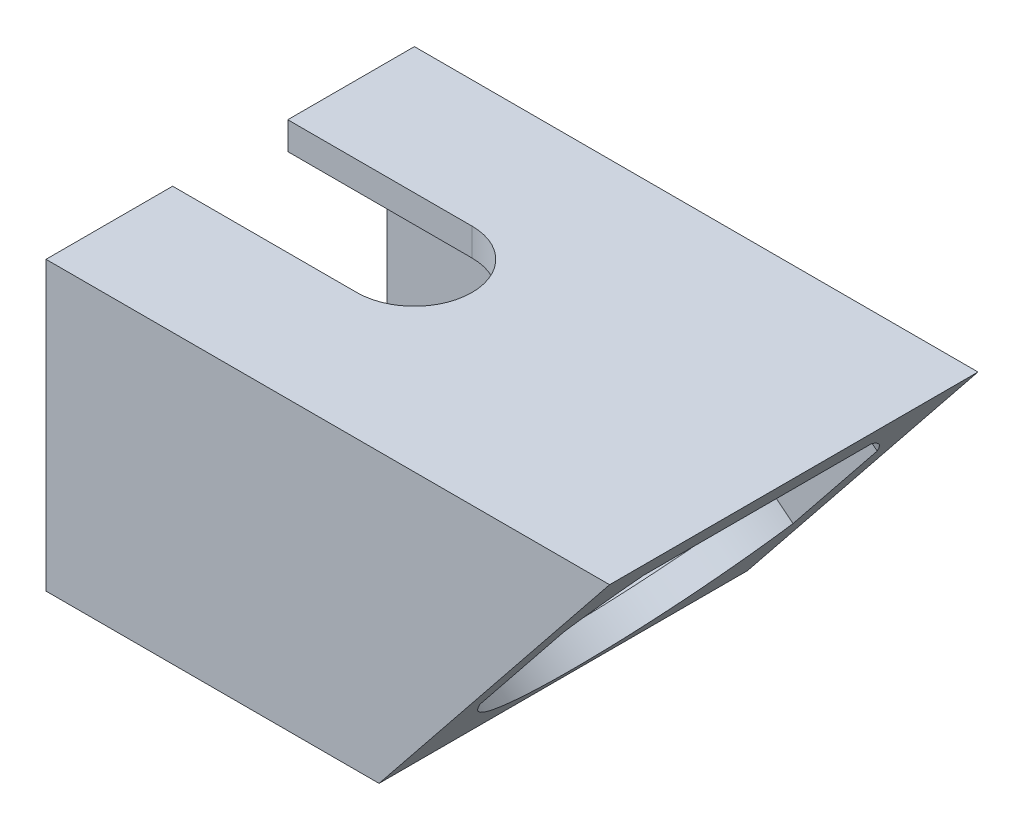
ISO-10303-21;
HEADER;
FILE_DESCRIPTION(('STEP AP214'),'2;1');
FILE_NAME('part.step','',(''),(''),'','','');
FILE_SCHEMA(('AUTOMOTIVE_DESIGN { 1 0 10303 214 1 1 1 1 }'));
ENDSEC;
DATA;
#1=APPLICATION_CONTEXT('core data for automotive mechanical design processes');
#2=APPLICATION_PROTOCOL_DEFINITION('international standard','automotive_design',2000,#1);
#3=PRODUCT_CONTEXT('',#1,'mechanical');
#4=PRODUCT('Part','Part','',(#3));
#5=PRODUCT_RELATED_PRODUCT_CATEGORY('part','',(#4));
#6=PRODUCT_DEFINITION_FORMATION('','',#4);
#7=PRODUCT_DEFINITION_CONTEXT('part definition',#1,'design');
#8=PRODUCT_DEFINITION('design','',#6,#7);
#9=PRODUCT_DEFINITION_SHAPE('','',#8);
#10=(LENGTH_UNIT() NAMED_UNIT(*) SI_UNIT(.MILLI.,.METRE.));
#11=(NAMED_UNIT(*) PLANE_ANGLE_UNIT() SI_UNIT($,.RADIAN.));
#12=(NAMED_UNIT(*) SI_UNIT($,.STERADIAN.) SOLID_ANGLE_UNIT());
#13=UNCERTAINTY_MEASURE_WITH_UNIT(LENGTH_MEASURE(1.E-05),#10,'distance_accuracy_value','');
#14=(GEOMETRIC_REPRESENTATION_CONTEXT(3) GLOBAL_UNCERTAINTY_ASSIGNED_CONTEXT((#13)) GLOBAL_UNIT_ASSIGNED_CONTEXT((#10,
#11,#12)) REPRESENTATION_CONTEXT('',''));
#15=CARTESIAN_POINT('',(0.,0.,0.));
#16=DIRECTION('',(0.,0.,1.));
#17=DIRECTION('',(1.,0.,0.));
#18=AXIS2_PLACEMENT_3D('',#15,#16,#17);
#19=CARTESIAN_POINT('',(38.8511805554592,-2.92266145834056,-20.));
#20=DIRECTION('',(0.78,-0.625779513886481,0.));
#21=DIRECTION('',(0.625779513886481,0.78,0.));
#22=AXIS2_PLACEMENT_3D('',#19,#20,#21);
#23=PLANE('',#22);
#24=DIRECTION('',(0.,0.,-1.));
#25=VECTOR('',#24,1.);
#26=CARTESIAN_POINT('',(34.9381824251266,-7.79999999999999,17.));
#27=LINE('',#26,#25);
#28=CARTESIAN_POINT('',(34.9381824251266,-7.79999999999998,17.));
#29=VERTEX_POINT('',#28);
#30=CARTESIAN_POINT('',(34.9381824251266,-7.79999999999999,12.3802237296166));
#31=VERTEX_POINT('',#30);
#32=EDGE_CURVE('E255',#29,#31,#27,.T.);
#33=ORIENTED_EDGE('',*,*,#32,.T.);
#34=CARTESIAN_POINT('',(26.3355902777296,-18.5226614583406,0.));
#35=DIRECTION('',(-0.78,0.625779513886481,0.));
#36=DIRECTION('',(-0.625779513886481,-0.78,0.));
#37=AXIS2_PLACEMENT_3D('',#34,#35,#36);
#38=CIRCLE('',#37,18.5);
#39=CARTESIAN_POINT('',(30.902065942835,-12.8307988458033,17.));
#40=VERTEX_POINT('',#39);
#41=EDGE_CURVE('E202',#40,#31,#38,.T.);
#42=ORIENTED_EDGE('',*,*,#41,.F.);
#43=DIRECTION('',(0.625779513886481,0.78,0.));
#44=VECTOR('',#43,1.);
#45=CARTESIAN_POINT('',(38.7640405728007,-3.03127668936898,17.));
#46=LINE('',#45,#44);
#47=EDGE_CURVE('E264',#40,#29,#46,.T.);
#48=ORIENTED_EDGE('',*,*,#47,.T.);
#49=EDGE_LOOP('',(#33,#42,#48));
#50=FACE_BOUND('',#49,.T.);
#51=ADVANCED_FACE('F35',(#50),#23,.F.);
#52=DIRECTION('',(-0.625779513886481,-0.78,0.));
#53=VECTOR('',#52,1.);
#54=CARTESIAN_POINT('',(51.0643626977534,12.300403310631,-17.));
#55=LINE('',#54,#53);
#56=CARTESIAN_POINT('',(34.9381824251266,-7.79999999999999,-17.));
#57=VERTEX_POINT('',#56);
#58=CARTESIAN_POINT('',(30.902065942835,-12.8307988458032,-17.));
#59=VERTEX_POINT('',#58);
#60=EDGE_CURVE('E250',#57,#59,#55,.T.);
#61=ORIENTED_EDGE('',*,*,#60,.T.);
#62=CARTESIAN_POINT('',(26.3355902777296,-18.5226614583406,0.));
#63=DIRECTION('',(-0.78,0.625779513886481,0.));
#64=DIRECTION('',(-0.625779513886481,-0.78,0.));
#65=AXIS2_PLACEMENT_3D('',#62,#63,#64);
#66=CIRCLE('',#65,18.5);
#67=CARTESIAN_POINT('',(34.9381824251266,-7.79999999999999,-12.3802237296166));
#68=VERTEX_POINT('',#67);
#69=EDGE_CURVE('E196',#68,#59,#66,.T.);
#70=ORIENTED_EDGE('',*,*,#69,.F.);
#71=EDGE_CURVE('E259',#68,#57,#27,.T.);
#72=ORIENTED_EDGE('',*,*,#71,.T.);
#73=EDGE_LOOP('',(#61,#70,#72));
#74=FACE_BOUND('',#73,.T.);
#75=ADVANCED_FACE('F334',(#74),#23,.F.);
#76=CARTESIAN_POINT('',(-20.,-4.8,-20.));
#77=DIRECTION('',(-1.,0.,0.));
#78=DIRECTION('',(0.,-1.,0.));
#79=AXIS2_PLACEMENT_3D('',#76,#77,#78);
#80=PLANE('',#79);
#81=DIRECTION('',(0.,1.,0.));
#82=VECTOR('',#81,1.);
#83=CARTESIAN_POINT('',(-20.,-36.001,-6.25));
#84=LINE('',#83,#82);
#85=CARTESIAN_POINT('',(-20.,-7.8,-6.25));
#86=VERTEX_POINT('',#85);
#87=CARTESIAN_POINT('',(-20.,-4.8,-6.25));
#88=VERTEX_POINT('',#87);
#89=EDGE_CURVE('E191',#86,#88,#84,.T.);
#90=ORIENTED_EDGE('',*,*,#89,.T.);
#91=DIRECTION('',(0.,0.,1.));
#92=VECTOR('',#91,1.);
#93=CARTESIAN_POINT('',(-20.,-4.8,-20.));
#94=LINE('',#93,#92);
#95=CARTESIAN_POINT('',(-20.,-4.8,-20.));
#96=VERTEX_POINT('',#95);
#97=EDGE_CURVE('E12',#96,#88,#94,.T.);
#98=ORIENTED_EDGE('',*,*,#97,.F.);
#99=DIRECTION('',(0.,-1.,0.));
#100=VECTOR('',#99,1.);
#101=CARTESIAN_POINT('',(-20.,-4.8,-20.));
#102=LINE('',#101,#100);
#103=CARTESIAN_POINT('',(-20.,-36.,-20.));
#104=VERTEX_POINT('',#103);
#105=EDGE_CURVE('E282',#96,#104,#102,.T.);
#106=ORIENTED_EDGE('',*,*,#105,.T.);
#107=DIRECTION('',(0.,0.,1.));
#108=VECTOR('',#107,1.);
#109=CARTESIAN_POINT('',(-20.,-36.,-20.));
#110=LINE('',#109,#108);
#111=CARTESIAN_POINT('',(-20.,-36.,20.));
#112=VERTEX_POINT('',#111);
#113=EDGE_CURVE('E39',#104,#112,#110,.T.);
#114=ORIENTED_EDGE('',*,*,#113,.T.);
#115=DIRECTION('',(0.,-1.,0.));
#116=VECTOR('',#115,1.);
#117=CARTESIAN_POINT('',(-20.,-4.8,20.));
#118=LINE('',#117,#116);
#119=CARTESIAN_POINT('',(-20.,-4.8,20.));
#120=VERTEX_POINT('',#119);
#121=EDGE_CURVE('E270',#120,#112,#118,.T.);
#122=ORIENTED_EDGE('',*,*,#121,.F.);
#123=CARTESIAN_POINT('',(-20.,-4.8,6.25));
#124=VERTEX_POINT('',#123);
#125=EDGE_CURVE('E44',#124,#120,#94,.T.);
#126=ORIENTED_EDGE('',*,*,#125,.F.);
#127=DIRECTION('',(0.,1.,0.));
#128=VECTOR('',#127,1.);
#129=CARTESIAN_POINT('',(-20.,-36.001,6.25));
#130=LINE('',#129,#128);
#131=CARTESIAN_POINT('',(-20.,-7.8,6.25));
#132=VERTEX_POINT('',#131);
#133=EDGE_CURVE('E173',#132,#124,#130,.T.);
#134=ORIENTED_EDGE('',*,*,#133,.F.);
#135=DIRECTION('',(0.,0.,-1.));
#136=VECTOR('',#135,1.);
#137=CARTESIAN_POINT('',(-20.,-7.8,17.));
#138=LINE('',#137,#136);
#139=CARTESIAN_POINT('',(-20.,-7.8,17.));
#140=VERTEX_POINT('',#139);
#141=EDGE_CURVE('E183',#140,#132,#138,.T.);
#142=ORIENTED_EDGE('',*,*,#141,.F.);
#143=DIRECTION('',(0.,1.,0.));
#144=VECTOR('',#143,1.);
#145=CARTESIAN_POINT('',(-20.,-33.,17.));
#146=LINE('',#145,#144);
#147=CARTESIAN_POINT('',(-20.,-33.,17.));
#148=VERTEX_POINT('',#147);
#149=EDGE_CURVE('E239',#148,#140,#146,.T.);
#150=ORIENTED_EDGE('',*,*,#149,.F.);
#151=DIRECTION('',(0.,0.,1.));
#152=VECTOR('',#151,1.);
#153=CARTESIAN_POINT('',(-20.,-33.,-17.));
#154=LINE('',#153,#152);
#155=CARTESIAN_POINT('',(-20.,-33.,-17.));
#156=VERTEX_POINT('',#155);
#157=EDGE_CURVE('E242',#156,#148,#154,.T.);
#158=ORIENTED_EDGE('',*,*,#157,.F.);
#159=DIRECTION('',(0.,-1.,0.));
#160=VECTOR('',#159,1.);
#161=CARTESIAN_POINT('',(-20.,-7.8,-17.));
#162=LINE('',#161,#160);
#163=CARTESIAN_POINT('',(-20.,-7.79999999999999,-17.));
#164=VERTEX_POINT('',#163);
#165=EDGE_CURVE('E235',#164,#156,#162,.T.);
#166=ORIENTED_EDGE('',*,*,#165,.F.);
#167=EDGE_CURVE('E238',#86,#164,#138,.T.);
#168=ORIENTED_EDGE('',*,*,#167,.F.);
#169=EDGE_LOOP('',(#90,#98,#106,#114,#122,#126,#134,#142,#150,#158,#166,#168));
#170=FACE_BOUND('',#169,.T.);
#171=ADVANCED_FACE('F37',(#170),#80,.T.);
#172=CARTESIAN_POINT('',(-20.,-4.8,-20.));
#173=DIRECTION('',(0.,1.,0.));
#174=DIRECTION('',(-1.,0.,0.));
#175=AXIS2_PLACEMENT_3D('',#172,#173,#174);
#176=PLANE('',#175);
#177=DIRECTION('',(-1.,0.,0.));
#178=VECTOR('',#177,1.);
#179=CARTESIAN_POINT('',(0.,-4.8,-6.25));
#180=LINE('',#179,#178);
#181=CARTESIAN_POINT('',(0.,-4.8,-6.25));
#182=VERTEX_POINT('',#181);
#183=EDGE_CURVE('E387',#182,#88,#180,.T.);
#184=ORIENTED_EDGE('',*,*,#183,.F.);
#185=CARTESIAN_POINT('',(0.,-4.8,0.));
#186=DIRECTION('',(0.,1.,0.));
#187=DIRECTION('',(-1.,0.,0.));
#188=AXIS2_PLACEMENT_3D('',#185,#186,#187);
#189=CIRCLE('',#188,6.25);
#190=CARTESIAN_POINT('',(0.,-4.8,6.25));
#191=VERTEX_POINT('',#190);
#192=EDGE_CURVE('E185',#191,#182,#189,.T.);
#193=ORIENTED_EDGE('',*,*,#192,.F.);
#194=DIRECTION('',(1.,0.,0.));
#195=VECTOR('',#194,1.);
#196=CARTESIAN_POINT('',(0.,-4.8,6.25));
#197=LINE('',#196,#195);
#198=EDGE_CURVE('E168',#124,#191,#197,.T.);
#199=ORIENTED_EDGE('',*,*,#198,.F.);
#200=ORIENTED_EDGE('',*,*,#125,.T.);
#201=DIRECTION('',(-1.,0.,0.));
#202=VECTOR('',#201,1.);
#203=CARTESIAN_POINT('',(-20.,-4.8,20.));
#204=LINE('',#203,#202);
#205=CARTESIAN_POINT('',(41.1911805554592,-4.8,20.));
#206=VERTEX_POINT('',#205);
#207=EDGE_CURVE('E279',#206,#120,#204,.T.);
#208=ORIENTED_EDGE('',*,*,#207,.F.);
#209=DIRECTION('',(0.,0.,1.));
#210=VECTOR('',#209,1.);
#211=CARTESIAN_POINT('',(41.1911805554592,-4.8,-20.));
#212=LINE('',#211,#210);
#213=CARTESIAN_POINT('',(41.1911805554592,-4.8,-20.));
#214=VERTEX_POINT('',#213);
#215=EDGE_CURVE('E294',#214,#206,#212,.T.);
#216=ORIENTED_EDGE('',*,*,#215,.F.);
#217=DIRECTION('',(-1.,0.,0.));
#218=VECTOR('',#217,1.);
#219=CARTESIAN_POINT('',(-20.,-4.8,-20.));
#220=LINE('',#219,#218);
#221=EDGE_CURVE('E291',#214,#96,#220,.T.);
#222=ORIENTED_EDGE('',*,*,#221,.T.);
#223=ORIENTED_EDGE('',*,*,#97,.T.);
#224=EDGE_LOOP('',(#184,#193,#199,#200,#208,#216,#222,#223));
#225=FACE_BOUND('',#224,.T.);
#226=ADVANCED_FACE('F310',(#225),#176,.T.);
#227=CARTESIAN_POINT('',(41.1911805554592,-4.8,-20.));
#228=DIRECTION('',(0.78,-0.625779513886481,0.));
#229=DIRECTION('',(0.625779513886481,0.78,0.));
#230=AXIS2_PLACEMENT_3D('',#227,#228,#229);
#231=PLANE('',#230);
#232=DIRECTION('',(0.625779513886481,0.78,0.));
#233=VECTOR('',#232,1.);
#234=CARTESIAN_POINT('',(24.1091146126242,-26.0918626125373,17.));
#235=LINE('',#234,#233);
#236=CARTESIAN_POINT('',(24.1091146126242,-26.0918626125373,17.));
#237=VERTEX_POINT('',#236);
#238=CARTESIAN_POINT('',(33.242065942835,-14.7081373874627,17.));
#239=VERTEX_POINT('',#238);
#240=EDGE_CURVE('E198',#237,#239,#235,.T.);
#241=ORIENTED_EDGE('',*,*,#240,.T.);
#242=CARTESIAN_POINT('',(28.6755902777296,-20.4,0.));
#243=DIRECTION('',(0.78,-0.625779513886481,0.));
#244=DIRECTION('',(0.625779513886481,0.78,0.));
#245=AXIS2_PLACEMENT_3D('',#242,#243,#244);
#246=CIRCLE('',#245,18.5);
#247=CARTESIAN_POINT('',(37.2781824251266,-9.67733854165942,12.3802237296166));
#248=VERTEX_POINT('',#247);
#249=EDGE_CURVE('E225',#239,#248,#246,.F.);
#250=ORIENTED_EDGE('',*,*,#249,.T.);
#251=DIRECTION('',(0.,0.,-1.));
#252=VECTOR('',#251,1.);
#253=CARTESIAN_POINT('',(37.2781824251266,-9.67733854165943,12.3802237296166));
#254=LINE('',#253,#252);
#255=CARTESIAN_POINT('',(37.2781824251266,-9.67733854165943,-12.3802237296166));
#256=VERTEX_POINT('',#255);
#257=EDGE_CURVE('E221',#248,#256,#254,.T.);
#258=ORIENTED_EDGE('',*,*,#257,.T.);
#259=CARTESIAN_POINT('',(28.6755902777296,-20.4,0.));
#260=DIRECTION('',(0.78,-0.625779513886481,0.));
#261=DIRECTION('',(0.625779513886481,0.78,0.));
#262=AXIS2_PLACEMENT_3D('',#259,#260,#261);
#263=CIRCLE('',#262,18.5);
#264=CARTESIAN_POINT('',(33.242065942835,-14.7081373874627,-17.));
#265=VERTEX_POINT('',#264);
#266=EDGE_CURVE('E217',#256,#265,#263,.F.);
#267=ORIENTED_EDGE('',*,*,#266,.T.);
#268=DIRECTION('',(-0.625779513886481,-0.78,0.));
#269=VECTOR('',#268,1.);
#270=CARTESIAN_POINT('',(33.242065942835,-14.7081373874627,-17.));
#271=LINE('',#270,#269);
#272=CARTESIAN_POINT('',(24.1091146126242,-26.0918626125373,-17.));
#273=VERTEX_POINT('',#272);
#274=EDGE_CURVE('E213',#265,#273,#271,.T.);
#275=ORIENTED_EDGE('',*,*,#274,.T.);
#276=CARTESIAN_POINT('',(28.6755902777296,-20.4,0.));
#277=DIRECTION('',(0.78,-0.625779513886481,0.));
#278=DIRECTION('',(0.625779513886481,0.78,0.));
#279=AXIS2_PLACEMENT_3D('',#276,#277,#278);
#280=CIRCLE('',#279,18.5);
#281=EDGE_CURVE('E209',#273,#237,#280,.F.);
#282=ORIENTED_EDGE('',*,*,#281,.T.);
#283=EDGE_LOOP('',(#241,#250,#258,#267,#275,#282));
#284=FACE_BOUND('',#283,.T.);
#285=ORIENTED_EDGE('',*,*,#215,.T.);
#286=DIRECTION('',(0.625779513886481,0.78,0.));
#287=VECTOR('',#286,1.);
#288=CARTESIAN_POINT('',(41.1911805554592,-4.8,20.));
#289=LINE('',#288,#287);
#290=CARTESIAN_POINT('',(16.16,-36.,20.));
#291=VERTEX_POINT('',#290);
#292=EDGE_CURVE('E276',#291,#206,#289,.T.);
#293=ORIENTED_EDGE('',*,*,#292,.F.);
#294=DIRECTION('',(0.,0.,1.));
#295=VECTOR('',#294,1.);
#296=CARTESIAN_POINT('',(16.16,-36.,-20.));
#297=LINE('',#296,#295);
#298=CARTESIAN_POINT('',(16.16,-36.,-20.));
#299=VERTEX_POINT('',#298);
#300=EDGE_CURVE('E295',#299,#291,#297,.T.);
#301=ORIENTED_EDGE('',*,*,#300,.F.);
#302=DIRECTION('',(0.625779513886481,0.78,0.));
#303=VECTOR('',#302,1.);
#304=CARTESIAN_POINT('',(41.1911805554592,-4.8,-20.));
#305=LINE('',#304,#303);
#306=EDGE_CURVE('E288',#299,#214,#305,.T.);
#307=ORIENTED_EDGE('',*,*,#306,.T.);
#308=EDGE_LOOP('',(#285,#293,#301,#307));
#309=FACE_BOUND('',#308,.T.);
#310=ADVANCED_FACE('F341',(#284,#309),#231,.T.);
#311=CARTESIAN_POINT('',(16.16,-36.,-20.));
#312=DIRECTION('',(0.,-1.,0.));
#313=DIRECTION('',(1.,0.,0.));
#314=AXIS2_PLACEMENT_3D('',#311,#312,#313);
#315=PLANE('',#314);
#316=ORIENTED_EDGE('',*,*,#300,.T.);
#317=DIRECTION('',(1.,0.,0.));
#318=VECTOR('',#317,1.);
#319=CARTESIAN_POINT('',(16.16,-36.,20.));
#320=LINE('',#319,#318);
#321=EDGE_CURVE('E273',#112,#291,#320,.T.);
#322=ORIENTED_EDGE('',*,*,#321,.F.);
#323=ORIENTED_EDGE('',*,*,#113,.F.);
#324=DIRECTION('',(1.,0.,0.));
#325=VECTOR('',#324,1.);
#326=CARTESIAN_POINT('',(16.16,-36.,-20.));
#327=LINE('',#326,#325);
#328=EDGE_CURVE('E285',#104,#299,#327,.T.);
#329=ORIENTED_EDGE('',*,*,#328,.T.);
#330=EDGE_LOOP('',(#316,#322,#323,#329));
#331=FACE_BOUND('',#330,.T.);
#332=ADVANCED_FACE('F303',(#331),#315,.T.);
#333=CARTESIAN_POINT('',(0.,0.,-20.));
#334=DIRECTION('',(0.,0.,-1.));
#335=DIRECTION('',(-1.,0.,0.));
#336=AXIS2_PLACEMENT_3D('',#333,#334,#335);
#337=PLANE('',#336);
#338=ORIENTED_EDGE('',*,*,#105,.F.);
#339=ORIENTED_EDGE('',*,*,#221,.F.);
#340=ORIENTED_EDGE('',*,*,#306,.F.);
#341=ORIENTED_EDGE('',*,*,#328,.F.);
#342=EDGE_LOOP('',(#338,#339,#340,#341));
#343=FACE_BOUND('',#342,.T.);
#344=ADVANCED_FACE('F362',(#343),#337,.T.);
#345=CARTESIAN_POINT('',(0.,0.,20.));
#346=DIRECTION('',(0.,0.,-1.));
#347=DIRECTION('',(-1.,0.,0.));
#348=AXIS2_PLACEMENT_3D('',#345,#346,#347);
#349=PLANE('',#348);
#350=ORIENTED_EDGE('',*,*,#121,.T.);
#351=ORIENTED_EDGE('',*,*,#321,.T.);
#352=ORIENTED_EDGE('',*,*,#292,.T.);
#353=ORIENTED_EDGE('',*,*,#207,.T.);
#354=EDGE_LOOP('',(#350,#351,#352,#353));
#355=FACE_BOUND('',#354,.T.);
#356=ADVANCED_FACE('F306',(#355),#349,.F.);
#357=CARTESIAN_POINT('',(14.7206904380249,-33.,17.));
#358=VERTEX_POINT('',#357);
#359=CARTESIAN_POINT('',(21.7691146126242,-24.2145240708779,17.));
#360=VERTEX_POINT('',#359);
#361=EDGE_CURVE('E260',#358,#360,#46,.T.);
#362=ORIENTED_EDGE('',*,*,#361,.T.);
#363=CARTESIAN_POINT('',(26.3355902777296,-18.5226614583406,0.));
#364=DIRECTION('',(-0.78,0.625779513886481,0.));
#365=DIRECTION('',(-0.625779513886481,-0.78,0.));
#366=AXIS2_PLACEMENT_3D('',#363,#364,#365);
#367=CIRCLE('',#366,18.5);
#368=CARTESIAN_POINT('',(21.7691146126242,-24.2145240708779,-17.));
#369=VERTEX_POINT('',#368);
#370=EDGE_CURVE('E195',#369,#360,#367,.T.);
#371=ORIENTED_EDGE('',*,*,#370,.F.);
#372=CARTESIAN_POINT('',(14.7206904380249,-33.,-17.));
#373=VERTEX_POINT('',#372);
#374=EDGE_CURVE('E254',#369,#373,#55,.T.);
#375=ORIENTED_EDGE('',*,*,#374,.T.);
#376=DIRECTION('',(0.,0.,1.));
#377=VECTOR('',#376,1.);
#378=CARTESIAN_POINT('',(14.7206904380249,-33.,-17.));
#379=LINE('',#378,#377);
#380=EDGE_CURVE('E237',#373,#358,#379,.T.);
#381=ORIENTED_EDGE('',*,*,#380,.T.);
#382=EDGE_LOOP('',(#362,#371,#375,#381));
#383=FACE_BOUND('',#382,.T.);
#384=ADVANCED_FACE('F354',(#383),#23,.F.);
#385=CARTESIAN_POINT('',(76.1184180549191,-33.,-17.));
#386=DIRECTION('',(0.,-1.,0.));
#387=DIRECTION('',(1.,0.,0.));
#388=AXIS2_PLACEMENT_3D('',#385,#386,#387);
#389=PLANE('',#388);
#390=DIRECTION('',(-1.,0.,0.));
#391=VECTOR('',#390,1.);
#392=CARTESIAN_POINT('',(76.1184180549191,-33.,-17.));
#393=LINE('',#392,#391);
#394=EDGE_CURVE('E253',#373,#156,#393,.T.);
#395=ORIENTED_EDGE('',*,*,#394,.T.);
#396=ORIENTED_EDGE('',*,*,#157,.T.);
#397=DIRECTION('',(-1.,0.,0.));
#398=VECTOR('',#397,1.);
#399=CARTESIAN_POINT('',(76.1184180549191,-33.,17.));
#400=LINE('',#399,#398);
#401=EDGE_CURVE('E249',#358,#148,#400,.T.);
#402=ORIENTED_EDGE('',*,*,#401,.F.);
#403=ORIENTED_EDGE('',*,*,#380,.F.);
#404=EDGE_LOOP('',(#395,#396,#402,#403));
#405=FACE_BOUND('',#404,.T.);
#406=ADVANCED_FACE('F321',(#405),#389,.F.);
#407=CARTESIAN_POINT('',(76.1184180549191,-33.,17.));
#408=DIRECTION('',(0.,0.,1.));
#409=DIRECTION('',(1.,0.,0.));
#410=AXIS2_PLACEMENT_3D('',#407,#408,#409);
#411=PLANE('',#410);
#412=ORIENTED_EDGE('',*,*,#401,.T.);
#413=ORIENTED_EDGE('',*,*,#149,.T.);
#414=DIRECTION('',(-1.,0.,0.));
#415=VECTOR('',#414,1.);
#416=CARTESIAN_POINT('',(76.1184180549191,-7.79999999999998,17.));
#417=LINE('',#416,#415);
#418=EDGE_CURVE('E263',#29,#140,#417,.T.);
#419=ORIENTED_EDGE('',*,*,#418,.F.);
#420=ORIENTED_EDGE('',*,*,#47,.F.);
#421=DIRECTION('',(-0.78,0.625779513886481,0.));
#422=VECTOR('',#421,1.);
#423=CARTESIAN_POINT('',(69.7929452542537,-44.0322290382614,17.));
#424=LINE('',#423,#422);
#425=EDGE_CURVE('E208',#239,#40,#424,.T.);
#426=ORIENTED_EDGE('',*,*,#425,.F.);
#427=ORIENTED_EDGE('',*,*,#240,.F.);
#428=DIRECTION('',(-0.78,0.625779513886481,0.));
#429=VECTOR('',#428,1.);
#430=CARTESIAN_POINT('',(60.6599939240428,-55.415954263336,17.));
#431=LINE('',#430,#429);
#432=EDGE_CURVE('E60',#237,#360,#431,.T.);
#433=ORIENTED_EDGE('',*,*,#432,.T.);
#434=ORIENTED_EDGE('',*,*,#361,.F.);
#435=EDGE_LOOP('',(#412,#413,#419,#420,#426,#427,#433,#434));
#436=FACE_BOUND('',#435,.T.);
#437=ADVANCED_FACE('F316',(#436),#411,.F.);
#438=CARTESIAN_POINT('',(76.1184180549191,-7.79999999999998,17.));
#439=DIRECTION('',(0.,1.,0.));
#440=DIRECTION('',(-1.,0.,0.));
#441=AXIS2_PLACEMENT_3D('',#438,#439,#440);
#442=PLANE('',#441);
#443=CARTESIAN_POINT('',(0.,-7.8,0.));
#444=DIRECTION('',(0.,1.,0.));
#445=DIRECTION('',(-1.,0.,0.));
#446=AXIS2_PLACEMENT_3D('',#443,#444,#445);
#447=CIRCLE('',#446,6.25);
#448=CARTESIAN_POINT('',(0.,-7.8,-6.25));
#449=VERTEX_POINT('',#448);
#450=CARTESIAN_POINT('',(0.,-7.8,6.25));
#451=VERTEX_POINT('',#450);
#452=EDGE_CURVE('E176',#449,#451,#447,.F.);
#453=ORIENTED_EDGE('',*,*,#452,.F.);
#454=DIRECTION('',(1.,0.,0.));
#455=VECTOR('',#454,1.);
#456=CARTESIAN_POINT('',(0.,-7.8,-6.25));
#457=LINE('',#456,#455);
#458=EDGE_CURVE('E52',#86,#449,#457,.T.);
#459=ORIENTED_EDGE('',*,*,#458,.F.);
#460=ORIENTED_EDGE('',*,*,#167,.T.);
#461=DIRECTION('',(-1.,0.,0.));
#462=VECTOR('',#461,1.);
#463=CARTESIAN_POINT('',(76.1184180549191,-7.79999999999998,-17.));
#464=LINE('',#463,#462);
#465=EDGE_CURVE('E258',#57,#164,#464,.T.);
#466=ORIENTED_EDGE('',*,*,#465,.F.);
#467=ORIENTED_EDGE('',*,*,#71,.F.);
#468=DIRECTION('',(0.,0.,-1.));
#469=VECTOR('',#468,1.);
#470=CARTESIAN_POINT('',(34.9381824251266,-7.79999999999999,12.3802237296166));
#471=LINE('',#470,#469);
#472=EDGE_CURVE('E199',#31,#68,#471,.T.);
#473=ORIENTED_EDGE('',*,*,#472,.F.);
#474=ORIENTED_EDGE('',*,*,#32,.F.);
#475=ORIENTED_EDGE('',*,*,#418,.T.);
#476=ORIENTED_EDGE('',*,*,#141,.T.);
#477=DIRECTION('',(-1.,0.,0.));
#478=VECTOR('',#477,1.);
#479=CARTESIAN_POINT('',(0.,-7.8,6.25));
#480=LINE('',#479,#478);
#481=EDGE_CURVE('E165',#451,#132,#480,.T.);
#482=ORIENTED_EDGE('',*,*,#481,.F.);
#483=EDGE_LOOP('',(#453,#459,#460,#466,#467,#473,#474,#475,#476,#482));
#484=FACE_BOUND('',#483,.T.);
#485=ADVANCED_FACE('F181',(#484),#442,.F.);
#486=CARTESIAN_POINT('',(76.1184180549191,-7.79999999999998,-17.));
#487=DIRECTION('',(0.,0.,-1.));
#488=DIRECTION('',(-1.,0.,0.));
#489=AXIS2_PLACEMENT_3D('',#486,#487,#488);
#490=PLANE('',#489);
#491=ORIENTED_EDGE('',*,*,#465,.T.);
#492=ORIENTED_EDGE('',*,*,#165,.T.);
#493=ORIENTED_EDGE('',*,*,#394,.F.);
#494=ORIENTED_EDGE('',*,*,#374,.F.);
#495=DIRECTION('',(-0.78,0.625779513886481,0.));
#496=VECTOR('',#495,1.);
#497=CARTESIAN_POINT('',(60.6599939240428,-55.415954263336,-17.));
#498=LINE('',#497,#496);
#499=EDGE_CURVE('E212',#273,#369,#498,.T.);
#500=ORIENTED_EDGE('',*,*,#499,.F.);
#501=ORIENTED_EDGE('',*,*,#274,.F.);
#502=DIRECTION('',(-0.78,0.625779513886481,0.));
#503=VECTOR('',#502,1.);
#504=CARTESIAN_POINT('',(69.7929452542537,-44.0322290382614,-17.));
#505=LINE('',#504,#503);
#506=EDGE_CURVE('E216',#265,#59,#505,.T.);
#507=ORIENTED_EDGE('',*,*,#506,.T.);
#508=ORIENTED_EDGE('',*,*,#60,.F.);
#509=EDGE_LOOP('',(#491,#492,#493,#494,#500,#501,#507,#508));
#510=FACE_BOUND('',#509,.T.);
#511=ADVANCED_FACE('F325',(#510),#490,.F.);
#512=CARTESIAN_POINT('',(65.2264695891483,-49.7240916507987,0.));
#513=DIRECTION('',(-0.78,0.625779513886481,0.));
#514=DIRECTION('',(-0.625779513886481,-0.78,0.));
#515=AXIS2_PLACEMENT_3D('',#512,#513,#514);
#516=CYLINDRICAL_SURFACE('',#515,18.5);
#517=ORIENTED_EDGE('',*,*,#425,.T.);
#518=ORIENTED_EDGE('',*,*,#41,.T.);
#519=DIRECTION('',(-0.78,0.625779513886481,0.));
#520=VECTOR('',#519,1.);
#521=CARTESIAN_POINT('',(73.8290617365453,-39.0014301924581,12.3802237296166));
#522=LINE('',#521,#520);
#523=EDGE_CURVE('E224',#248,#31,#522,.T.);
#524=ORIENTED_EDGE('',*,*,#523,.F.);
#525=ORIENTED_EDGE('',*,*,#249,.F.);
#526=EDGE_LOOP('',(#517,#518,#524,#525));
#527=FACE_BOUND('',#526,.T.);
#528=ADVANCED_FACE('F347',(#527),#516,.F.);
#529=CARTESIAN_POINT('',(73.8290617365453,-39.0014301924581,12.3802237296166));
#530=DIRECTION('',(0.625779513886481,0.78,0.));
#531=DIRECTION('',(-0.78,0.625779513886481,0.));
#532=AXIS2_PLACEMENT_3D('',#529,#530,#531);
#533=PLANE('',#532);
#534=ORIENTED_EDGE('',*,*,#523,.T.);
#535=ORIENTED_EDGE('',*,*,#472,.T.);
#536=DIRECTION('',(-0.78,0.625779513886481,0.));
#537=VECTOR('',#536,1.);
#538=CARTESIAN_POINT('',(73.8290617365453,-39.0014301924581,-12.3802237296166));
#539=LINE('',#538,#537);
#540=EDGE_CURVE('E220',#256,#68,#539,.T.);
#541=ORIENTED_EDGE('',*,*,#540,.F.);
#542=ORIENTED_EDGE('',*,*,#257,.F.);
#543=EDGE_LOOP('',(#534,#535,#541,#542));
#544=FACE_BOUND('',#543,.T.);
#545=ADVANCED_FACE('F345',(#544),#533,.F.);
#546=CARTESIAN_POINT('',(65.2264695891483,-49.7240916507987,0.));
#547=DIRECTION('',(-0.78,0.625779513886481,0.));
#548=DIRECTION('',(-0.625779513886481,-0.78,0.));
#549=AXIS2_PLACEMENT_3D('',#546,#547,#548);
#550=CYLINDRICAL_SURFACE('',#549,18.5);
#551=ORIENTED_EDGE('',*,*,#540,.T.);
#552=ORIENTED_EDGE('',*,*,#69,.T.);
#553=ORIENTED_EDGE('',*,*,#506,.F.);
#554=ORIENTED_EDGE('',*,*,#266,.F.);
#555=EDGE_LOOP('',(#551,#552,#553,#554));
#556=FACE_BOUND('',#555,.T.);
#557=ADVANCED_FACE('F338',(#556),#550,.F.);
#558=CARTESIAN_POINT('',(65.2264695891483,-49.7240916507987,0.));
#559=DIRECTION('',(-0.78,0.625779513886481,0.));
#560=DIRECTION('',(-0.625779513886481,-0.78,0.));
#561=AXIS2_PLACEMENT_3D('',#558,#559,#560);
#562=CYLINDRICAL_SURFACE('',#561,18.5);
#563=ORIENTED_EDGE('',*,*,#499,.T.);
#564=ORIENTED_EDGE('',*,*,#370,.T.);
#565=ORIENTED_EDGE('',*,*,#432,.F.);
#566=ORIENTED_EDGE('',*,*,#281,.F.);
#567=EDGE_LOOP('',(#563,#564,#565,#566));
#568=FACE_BOUND('',#567,.T.);
#569=ADVANCED_FACE('F351',(#568),#562,.F.);
#570=CARTESIAN_POINT('',(0.,-36.001,-6.25));
#571=DIRECTION('',(0.,0.,-1.));
#572=DIRECTION('',(-1.,0.,0.));
#573=AXIS2_PLACEMENT_3D('',#570,#571,#572);
#574=PLANE('',#573);
#575=ORIENTED_EDGE('',*,*,#458,.T.);
#576=DIRECTION('',(0.,1.,0.));
#577=VECTOR('',#576,1.);
#578=CARTESIAN_POINT('',(0.,-36.001,-6.25));
#579=LINE('',#578,#577);
#580=EDGE_CURVE('E172',#449,#182,#579,.T.);
#581=ORIENTED_EDGE('',*,*,#580,.T.);
#582=ORIENTED_EDGE('',*,*,#183,.T.);
#583=ORIENTED_EDGE('',*,*,#89,.F.);
#584=EDGE_LOOP('',(#575,#581,#582,#583));
#585=FACE_BOUND('',#584,.T.);
#586=ADVANCED_FACE('F389',(#585),#574,.F.);
#587=CARTESIAN_POINT('',(0.,-36.001,6.25));
#588=DIRECTION('',(0.,0.,1.));
#589=DIRECTION('',(1.,0.,0.));
#590=AXIS2_PLACEMENT_3D('',#587,#588,#589);
#591=PLANE('',#590);
#592=ORIENTED_EDGE('',*,*,#481,.T.);
#593=ORIENTED_EDGE('',*,*,#133,.T.);
#594=ORIENTED_EDGE('',*,*,#198,.T.);
#595=DIRECTION('',(0.,1.,0.));
#596=VECTOR('',#595,1.);
#597=CARTESIAN_POINT('',(0.,-36.001,6.25));
#598=LINE('',#597,#596);
#599=EDGE_CURVE('E161',#451,#191,#598,.T.);
#600=ORIENTED_EDGE('',*,*,#599,.F.);
#601=EDGE_LOOP('',(#592,#593,#594,#600));
#602=FACE_BOUND('',#601,.T.);
#603=ADVANCED_FACE('F163',(#602),#591,.F.);
#604=CARTESIAN_POINT('',(0.,-36.001,0.));
#605=DIRECTION('',(0.,1.,0.));
#606=DIRECTION('',(-1.,0.,0.));
#607=AXIS2_PLACEMENT_3D('',#604,#605,#606);
#608=CYLINDRICAL_SURFACE('',#607,6.25);
#609=ORIENTED_EDGE('',*,*,#452,.T.);
#610=ORIENTED_EDGE('',*,*,#599,.T.);
#611=ORIENTED_EDGE('',*,*,#192,.T.);
#612=ORIENTED_EDGE('',*,*,#580,.F.);
#613=EDGE_LOOP('',(#609,#610,#611,#612));
#614=FACE_BOUND('',#613,.T.);
#615=ADVANCED_FACE('F177',(#614),#608,.F.);
#616=CLOSED_SHELL('',(#51,#75,#171,#226,#310,#332,#344,#356,#384,#406,#437,#485,#511,#528,#545,
#557,#569,#586,#603,#615));
#617=MANIFOLD_SOLID_BREP('B2',#616);
#618=ADVANCED_BREP_SHAPE_REPRESENTATION('',(#18,#617),#14);
#619=SHAPE_DEFINITION_REPRESENTATION(#9,#618);
ENDSEC;
END-ISO-10303-21;
